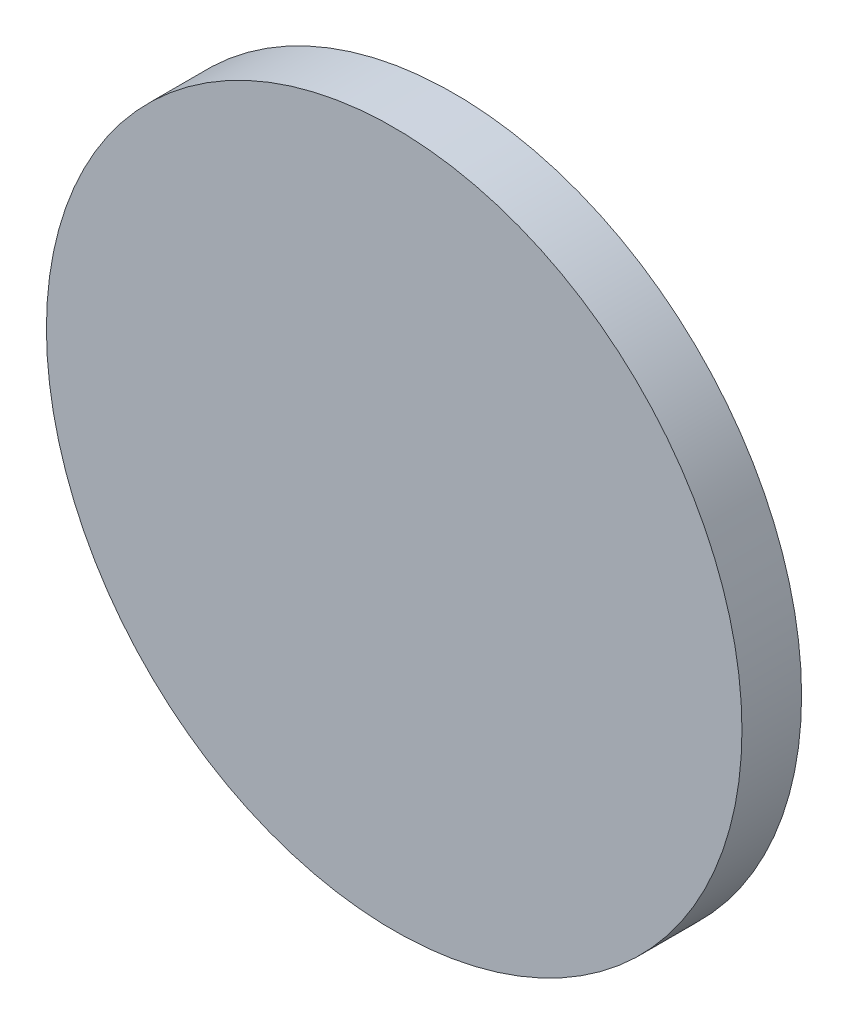
ISO-10303-21;
HEADER;
FILE_DESCRIPTION(('STEP AP214'),'2;1');
FILE_NAME('part.step','',(''),(''),'','','');
FILE_SCHEMA(('AUTOMOTIVE_DESIGN { 1 0 10303 214 1 1 1 1 }'));
ENDSEC;
DATA;
#1=APPLICATION_CONTEXT('core data for automotive mechanical design processes');
#2=APPLICATION_PROTOCOL_DEFINITION('international standard','automotive_design',2000,#1);
#3=PRODUCT_CONTEXT('',#1,'mechanical');
#4=PRODUCT('Part','Part','',(#3));
#5=PRODUCT_RELATED_PRODUCT_CATEGORY('part','',(#4));
#6=PRODUCT_DEFINITION_FORMATION('','',#4);
#7=PRODUCT_DEFINITION_CONTEXT('part definition',#1,'design');
#8=PRODUCT_DEFINITION('design','',#6,#7);
#9=PRODUCT_DEFINITION_SHAPE('','',#8);
#10=(LENGTH_UNIT() NAMED_UNIT(*) SI_UNIT(.MILLI.,.METRE.));
#11=(NAMED_UNIT(*) PLANE_ANGLE_UNIT() SI_UNIT($,.RADIAN.));
#12=(NAMED_UNIT(*) SI_UNIT($,.STERADIAN.) SOLID_ANGLE_UNIT());
#13=UNCERTAINTY_MEASURE_WITH_UNIT(LENGTH_MEASURE(1.E-05),#10,'distance_accuracy_value','');
#14=(GEOMETRIC_REPRESENTATION_CONTEXT(3) GLOBAL_UNCERTAINTY_ASSIGNED_CONTEXT((#13)) GLOBAL_UNIT_ASSIGNED_CONTEXT((#10,
#11,#12)) REPRESENTATION_CONTEXT('',''));
#15=CARTESIAN_POINT('',(0.,0.,0.));
#16=DIRECTION('',(0.,0.,1.));
#17=DIRECTION('',(1.,0.,0.));
#18=AXIS2_PLACEMENT_3D('',#15,#16,#17);
#19=CARTESIAN_POINT('',(5.8674,9.8171,0.03429));
#20=DIRECTION('',(0.,0.,1.));
#21=DIRECTION('',(1.,0.,0.));
#22=AXIS2_PLACEMENT_3D('',#19,#20,#21);
#23=PLANE('',#22);
#24=CARTESIAN_POINT('',(5.8674,9.8171,0.03429));
#25=DIRECTION('',(0.,0.,1.));
#26=DIRECTION('',(1.,0.,0.));
#27=AXIS2_PLACEMENT_3D('',#24,#25,#26);
#28=CIRCLE('',#27,0.200024667);
#29=CARTESIAN_POINT('',(6.067424667,9.8171,0.03429));
#30=VERTEX_POINT('',#29);
#31=EDGE_CURVE('E18',#30,#30,#28,.F.);
#32=ORIENTED_EDGE('',*,*,#31,.F.);
#33=EDGE_LOOP('',(#32));
#34=FACE_BOUND('',#33,.T.);
#35=ADVANCED_FACE('F15',(#34),#23,.T.);
#36=CARTESIAN_POINT('',(5.8674,9.8171,0.));
#37=DIRECTION('',(0.,0.,1.));
#38=DIRECTION('',(1.,0.,0.));
#39=AXIS2_PLACEMENT_3D('',#36,#37,#38);
#40=CYLINDRICAL_SURFACE('',#39,0.200024667);
#41=ORIENTED_EDGE('',*,*,#31,.T.);
#42=EDGE_LOOP('',(#41));
#43=FACE_BOUND('',#42,.T.);
#44=CARTESIAN_POINT('',(5.8674,9.8171,0.));
#45=DIRECTION('',(0.,0.,1.));
#46=DIRECTION('',(1.,0.,0.));
#47=AXIS2_PLACEMENT_3D('',#44,#45,#46);
#48=CIRCLE('',#47,0.200024667);
#49=CARTESIAN_POINT('',(6.067424667,9.8171,0.));
#50=VERTEX_POINT('',#49);
#51=EDGE_CURVE('E10',#50,#50,#48,.F.);
#52=ORIENTED_EDGE('',*,*,#51,.F.);
#53=EDGE_LOOP('',(#52));
#54=FACE_BOUND('',#53,.T.);
#55=ADVANCED_FACE('F27',(#43,#54),#40,.T.);
#56=CARTESIAN_POINT('',(5.8674,9.8171,0.));
#57=DIRECTION('',(0.,0.,-1.));
#58=DIRECTION('',(-1.,0.,0.));
#59=AXIS2_PLACEMENT_3D('',#56,#57,#58);
#60=PLANE('',#59);
#61=ORIENTED_EDGE('',*,*,#51,.T.);
#62=EDGE_LOOP('',(#61));
#63=FACE_BOUND('',#62,.T.);
#64=ADVANCED_FACE('F35',(#63),#60,.T.);
#65=CLOSED_SHELL('',(#35,#55,#64));
#66=MANIFOLD_SOLID_BREP('B1',#65);
#67=ADVANCED_BREP_SHAPE_REPRESENTATION('',(#18,#66),#14);
#68=SHAPE_DEFINITION_REPRESENTATION(#9,#67);
ENDSEC;
END-ISO-10303-21;
